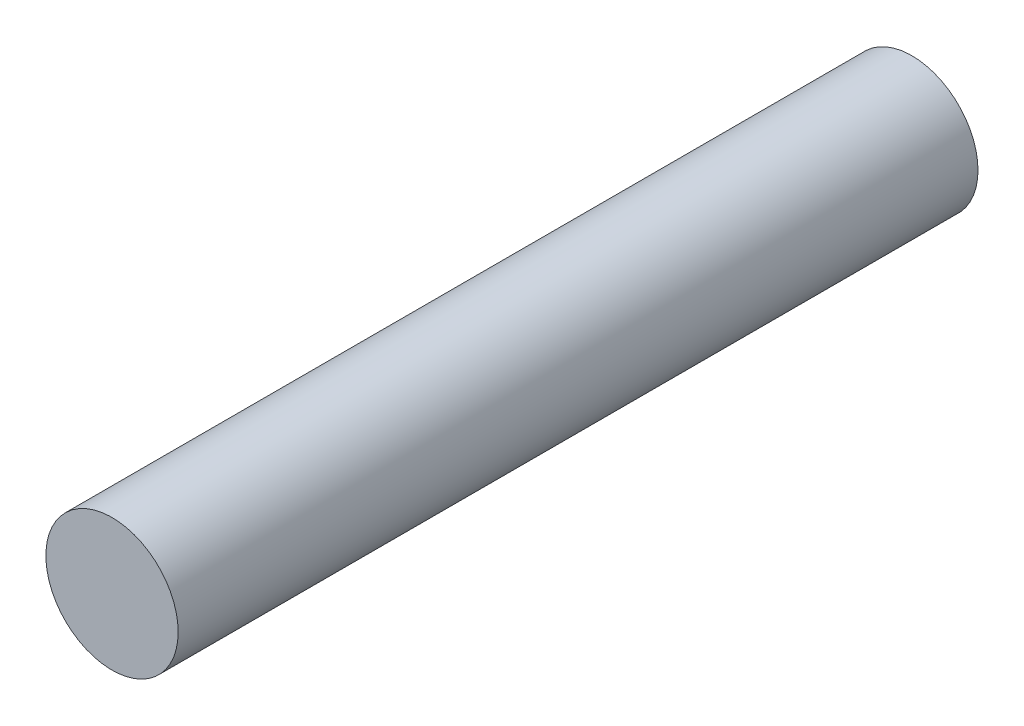
ISO-10303-21;
HEADER;
FILE_DESCRIPTION(('STEP AP214'),'2;1');
FILE_NAME('part.step','',(''),(''),'','','');
FILE_SCHEMA(('AUTOMOTIVE_DESIGN { 1 0 10303 214 1 1 1 1 }'));
ENDSEC;
DATA;
#1=APPLICATION_CONTEXT('core data for automotive mechanical design processes');
#2=APPLICATION_PROTOCOL_DEFINITION('international standard','automotive_design',2000,#1);
#3=PRODUCT_CONTEXT('',#1,'mechanical');
#4=PRODUCT('Part','Part','',(#3));
#5=PRODUCT_RELATED_PRODUCT_CATEGORY('part','',(#4));
#6=PRODUCT_DEFINITION_FORMATION('','',#4);
#7=PRODUCT_DEFINITION_CONTEXT('part definition',#1,'design');
#8=PRODUCT_DEFINITION('design','',#6,#7);
#9=PRODUCT_DEFINITION_SHAPE('','',#8);
#10=(LENGTH_UNIT() NAMED_UNIT(*) SI_UNIT(.MILLI.,.METRE.));
#11=(NAMED_UNIT(*) PLANE_ANGLE_UNIT() SI_UNIT($,.RADIAN.));
#12=(NAMED_UNIT(*) SI_UNIT($,.STERADIAN.) SOLID_ANGLE_UNIT());
#13=UNCERTAINTY_MEASURE_WITH_UNIT(LENGTH_MEASURE(1.E-05),#10,'distance_accuracy_value','');
#14=(GEOMETRIC_REPRESENTATION_CONTEXT(3) GLOBAL_UNCERTAINTY_ASSIGNED_CONTEXT((#13)) GLOBAL_UNIT_ASSIGNED_CONTEXT((#10,
#11,#12)) REPRESENTATION_CONTEXT('',''));
#15=CARTESIAN_POINT('',(0.,0.,0.));
#16=DIRECTION('',(0.,0.,1.));
#17=DIRECTION('',(1.,0.,0.));
#18=AXIS2_PLACEMENT_3D('',#15,#16,#17);
#19=CARTESIAN_POINT('',(0.,0.,26.));
#20=DIRECTION('',(0.,0.,-1.));
#21=DIRECTION('',(-1.,0.,0.));
#22=AXIS2_PLACEMENT_3D('',#19,#20,#21);
#23=CYLINDRICAL_SURFACE('',#22,2.15);
#24=CARTESIAN_POINT('',(0.,0.,26.));
#25=DIRECTION('',(0.,0.,1.));
#26=DIRECTION('',(1.,0.,0.));
#27=AXIS2_PLACEMENT_3D('',#24,#25,#26);
#28=CIRCLE('',#27,2.15);
#29=CARTESIAN_POINT('',(2.15,0.,26.));
#30=VERTEX_POINT('',#29);
#31=EDGE_CURVE('E10',#30,#30,#28,.T.);
#32=ORIENTED_EDGE('',*,*,#31,.F.);
#33=EDGE_LOOP('',(#32));
#34=FACE_BOUND('',#33,.T.);
#35=CARTESIAN_POINT('',(0.,0.,0.));
#36=DIRECTION('',(0.,0.,1.));
#37=DIRECTION('',(1.,0.,0.));
#38=AXIS2_PLACEMENT_3D('',#35,#36,#37);
#39=CIRCLE('',#38,2.15);
#40=CARTESIAN_POINT('',(2.15,0.,0.));
#41=VERTEX_POINT('',#40);
#42=EDGE_CURVE('E34',#41,#41,#39,.T.);
#43=ORIENTED_EDGE('',*,*,#42,.T.);
#44=EDGE_LOOP('',(#43));
#45=FACE_BOUND('',#44,.T.);
#46=ADVANCED_FACE('F31',(#34,#45),#23,.T.);
#47=CARTESIAN_POINT('',(0.,0.,26.));
#48=DIRECTION('',(0.,0.,1.));
#49=DIRECTION('',(1.,0.,0.));
#50=AXIS2_PLACEMENT_3D('',#47,#48,#49);
#51=PLANE('',#50);
#52=ORIENTED_EDGE('',*,*,#31,.T.);
#53=EDGE_LOOP('',(#52));
#54=FACE_BOUND('',#53,.T.);
#55=ADVANCED_FACE('F46',(#54),#51,.T.);
#56=CARTESIAN_POINT('',(0.,0.,0.));
#57=DIRECTION('',(0.,0.,1.));
#58=DIRECTION('',(1.,0.,0.));
#59=AXIS2_PLACEMENT_3D('',#56,#57,#58);
#60=PLANE('',#59);
#61=ORIENTED_EDGE('',*,*,#42,.F.);
#62=EDGE_LOOP('',(#61));
#63=FACE_BOUND('',#62,.T.);
#64=ADVANCED_FACE('F44',(#63),#60,.F.);
#65=CLOSED_SHELL('',(#46,#55,#64));
#66=MANIFOLD_SOLID_BREP('B2',#65);
#67=ADVANCED_BREP_SHAPE_REPRESENTATION('',(#18,#66),#14);
#68=SHAPE_DEFINITION_REPRESENTATION(#9,#67);
ENDSEC;
END-ISO-10303-21;
